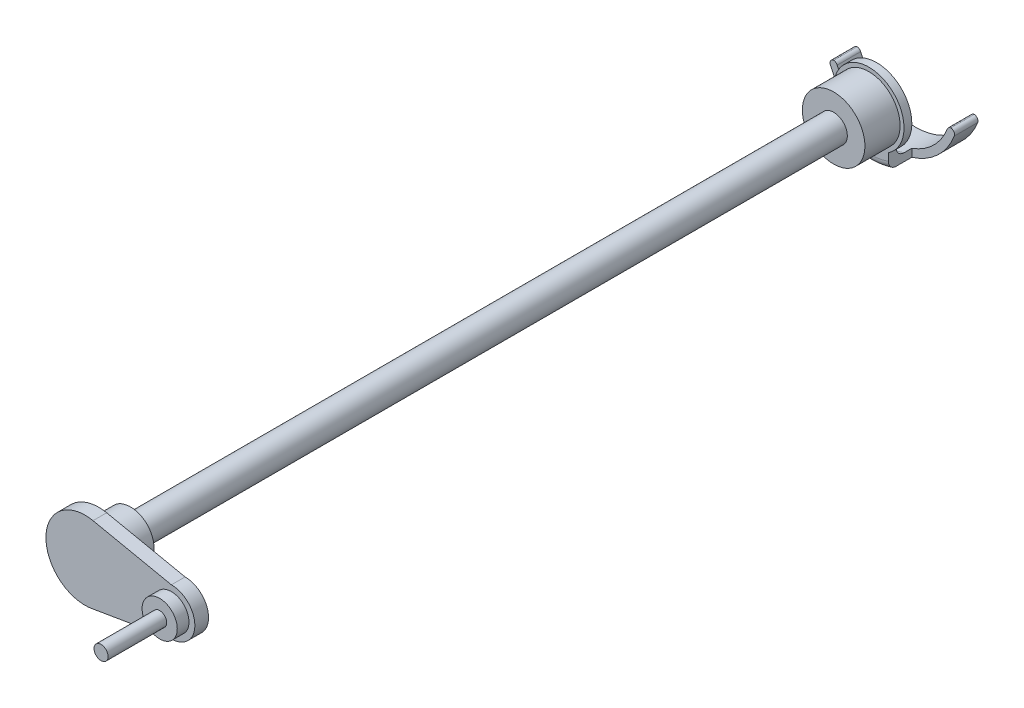
ISO-10303-21;
HEADER;
FILE_DESCRIPTION(('STEP AP214'),'2;1');
FILE_NAME('part.step','',(''),(''),'','','');
FILE_SCHEMA(('AUTOMOTIVE_DESIGN { 1 0 10303 214 1 1 1 1 }'));
ENDSEC;
DATA;
#1=APPLICATION_CONTEXT('core data for automotive mechanical design processes');
#2=APPLICATION_PROTOCOL_DEFINITION('international standard','automotive_design',2000,#1);
#3=PRODUCT_CONTEXT('',#1,'mechanical');
#4=PRODUCT('Part','Part','',(#3));
#5=PRODUCT_RELATED_PRODUCT_CATEGORY('part','',(#4));
#6=PRODUCT_DEFINITION_FORMATION('','',#4);
#7=PRODUCT_DEFINITION_CONTEXT('part definition',#1,'design');
#8=PRODUCT_DEFINITION('design','',#6,#7);
#9=PRODUCT_DEFINITION_SHAPE('','',#8);
#10=(LENGTH_UNIT() NAMED_UNIT(*) SI_UNIT(.MILLI.,.METRE.));
#11=(NAMED_UNIT(*) PLANE_ANGLE_UNIT() SI_UNIT($,.RADIAN.));
#12=(NAMED_UNIT(*) SI_UNIT($,.STERADIAN.) SOLID_ANGLE_UNIT());
#13=UNCERTAINTY_MEASURE_WITH_UNIT(LENGTH_MEASURE(1.E-05),#10,'distance_accuracy_value','');
#14=(GEOMETRIC_REPRESENTATION_CONTEXT(3) GLOBAL_UNCERTAINTY_ASSIGNED_CONTEXT((#13)) GLOBAL_UNIT_ASSIGNED_CONTEXT((#10,
#11,#12)) REPRESENTATION_CONTEXT('',''));
#15=CARTESIAN_POINT('',(0.,0.,0.));
#16=DIRECTION('',(0.,0.,1.));
#17=DIRECTION('',(1.,0.,0.));
#18=AXIS2_PLACEMENT_3D('',#15,#16,#17);
#19=CARTESIAN_POINT('',(0.,0.,180.));
#20=DIRECTION('',(0.,0.,-1.));
#21=DIRECTION('',(-1.,0.,0.));
#22=AXIS2_PLACEMENT_3D('',#19,#20,#21);
#23=CYLINDRICAL_SURFACE('',#22,3.5);
#24=CARTESIAN_POINT('',(0.,0.,0.));
#25=DIRECTION('',(0.,0.,-1.));
#26=DIRECTION('',(-1.,0.,0.));
#27=AXIS2_PLACEMENT_3D('',#24,#25,#26);
#28=CIRCLE('',#27,3.5);
#29=CARTESIAN_POINT('',(-3.5,0.,0.));
#30=VERTEX_POINT('',#29);
#31=EDGE_CURVE('E225',#30,#30,#28,.T.);
#32=CARTESIAN_POINT('',(0.,0.,179.));
#33=DIRECTION('',(0.,0.,1.));
#34=DIRECTION('',(1.,0.,0.));
#35=AXIS2_PLACEMENT_3D('',#32,#33,#34);
#36=CIRCLE('',#35,3.5);
#37=CARTESIAN_POINT('',(-3.5,0.,179.));
#38=VERTEX_POINT('',#37);
#39=EDGE_CURVE('E263',#38,#38,#36,.T.);
#40=CARTESIAN_POINT('',(-3.5,0.,0.));
#41=CARTESIAN_POINT('',(-3.5,0.,1.86458333333336));
#42=CARTESIAN_POINT('',(-3.5,0.,3.7291666666667));
#43=CARTESIAN_POINT('',(-3.5,0.,7.45833333333336));
#44=CARTESIAN_POINT('',(-3.5,0.,9.32291666666669));
#45=CARTESIAN_POINT('',(-3.5,0.,13.0520833333334));
#46=CARTESIAN_POINT('',(-3.5,0.,14.9166666666667));
#47=CARTESIAN_POINT('',(-3.5,0.,18.6458333333334));
#48=CARTESIAN_POINT('',(-3.5,0.,20.5104166666667));
#49=CARTESIAN_POINT('',(-3.5,0.,24.2395833333334));
#50=CARTESIAN_POINT('',(-3.5,0.,26.1041666666667));
#51=CARTESIAN_POINT('',(-3.5,0.,29.8333333333333));
#52=CARTESIAN_POINT('',(-3.5,0.,31.6979166666667));
#53=CARTESIAN_POINT('',(-3.5,0.,35.4270833333334));
#54=CARTESIAN_POINT('',(-3.5,0.,37.2916666666667));
#55=CARTESIAN_POINT('',(-3.5,0.,41.0208333333334));
#56=CARTESIAN_POINT('',(-3.5,0.,42.8854166666667));
#57=CARTESIAN_POINT('',(-3.5,0.,46.6145833333333));
#58=CARTESIAN_POINT('',(-3.5,0.,48.4791666666667));
#59=CARTESIAN_POINT('',(-3.5,0.,52.2083333333333));
#60=CARTESIAN_POINT('',(-3.5,0.,54.0729166666667));
#61=CARTESIAN_POINT('',(-3.5,0.,57.8020833333333));
#62=CARTESIAN_POINT('',(-3.5,0.,59.6666666666667));
#63=CARTESIAN_POINT('',(-3.5,0.,63.3958333333333));
#64=CARTESIAN_POINT('',(-3.5,0.,65.2604166666667));
#65=CARTESIAN_POINT('',(-3.5,0.,68.9895833333333));
#66=CARTESIAN_POINT('',(-3.5,0.,70.8541666666667));
#67=CARTESIAN_POINT('',(-3.5,0.,74.5833333333333));
#68=CARTESIAN_POINT('',(-3.5,0.,76.4479166666667));
#69=CARTESIAN_POINT('',(-3.5,0.,80.1770833333333));
#70=CARTESIAN_POINT('',(-3.5,0.,82.0416666666667));
#71=CARTESIAN_POINT('',(-3.5,0.,85.7708333333333));
#72=CARTESIAN_POINT('',(-3.5,0.,87.6354166666667));
#73=CARTESIAN_POINT('',(-3.5,0.,91.3645833333333));
#74=CARTESIAN_POINT('',(-3.5,0.,93.2291666666667));
#75=CARTESIAN_POINT('',(-3.5,0.,96.9583333333333));
#76=CARTESIAN_POINT('',(-3.5,0.,98.8229166666667));
#77=CARTESIAN_POINT('',(-3.5,0.,102.552083333333));
#78=CARTESIAN_POINT('',(-3.5,0.,104.416666666667));
#79=CARTESIAN_POINT('',(-3.5,0.,108.145833333333));
#80=CARTESIAN_POINT('',(-3.5,0.,110.010416666667));
#81=CARTESIAN_POINT('',(-3.5,0.,113.739583333333));
#82=CARTESIAN_POINT('',(-3.5,0.,115.604166666667));
#83=CARTESIAN_POINT('',(-3.5,0.,119.333333333333));
#84=CARTESIAN_POINT('',(-3.5,0.,121.197916666667));
#85=CARTESIAN_POINT('',(-3.5,0.,124.927083333333));
#86=CARTESIAN_POINT('',(-3.5,0.,126.791666666667));
#87=CARTESIAN_POINT('',(-3.5,0.,130.520833333333));
#88=CARTESIAN_POINT('',(-3.5,0.,132.385416666667));
#89=CARTESIAN_POINT('',(-3.5,0.,136.114583333333));
#90=CARTESIAN_POINT('',(-3.5,0.,137.979166666667));
#91=CARTESIAN_POINT('',(-3.5,0.,141.708333333333));
#92=CARTESIAN_POINT('',(-3.5,0.,143.572916666667));
#93=CARTESIAN_POINT('',(-3.5,0.,147.302083333333));
#94=CARTESIAN_POINT('',(-3.5,0.,149.166666666667));
#95=CARTESIAN_POINT('',(-3.5,0.,152.895833333333));
#96=CARTESIAN_POINT('',(-3.5,0.,154.760416666667));
#97=CARTESIAN_POINT('',(-3.5,0.,158.489583333333));
#98=CARTESIAN_POINT('',(-3.5,0.,160.354166666667));
#99=CARTESIAN_POINT('',(-3.5,0.,164.083333333333));
#100=CARTESIAN_POINT('',(-3.5,0.,165.947916666667));
#101=CARTESIAN_POINT('',(-3.5,0.,169.677083333333));
#102=CARTESIAN_POINT('',(-3.5,0.,171.541666666667));
#103=CARTESIAN_POINT('',(-3.5,0.,175.270833333333));
#104=CARTESIAN_POINT('',(-3.5,0.,177.135416666667));
#105=CARTESIAN_POINT('',(-3.5,0.,179.));
#106=B_SPLINE_CURVE_WITH_KNOTS('',3,(#40,#41,#42,#43,#44,#45,#46,#47,#48,#49,#50,#51,#52,#53,
#54,#55,#56,#57,#58,#59,#60,#61,#62,#63,#64,#65,#66,#67,#68,#69,#70,#71,#72,#73,#74,#75,#76,#77,
#78,#79,#80,#81,#82,#83,#84,#85,#86,#87,#88,#89,#90,#91,#92,#93,#94,#95,#96,#97,#98,#99,#100,
#101,#102,#103,#104,#105),.UNSPECIFIED.,.F.,.F.,(4,2,2,2,2,2,2,2,2,2,2,2,2,2,2,2,2,2,2,2,2,2,2,
2,2,2,2,2,2,2,2,2,4),(0.,5.59375000000001,11.1875,16.78125,22.375,27.96875,33.5625,39.15625,
44.75,50.34375,55.9375,61.53125,67.125,72.71875,78.3125,83.90625,89.5,95.09375,100.6875,
106.28125,111.875,117.46875,123.0625,128.65625,134.25,139.84375,145.4375,151.03125,156.625,
162.21875,167.8125,173.40625,179.),.UNSPECIFIED.);
#107=EDGE_CURVE('BSEAM37',#30,#38,#106,.T.);
#108=ORIENTED_EDGE('',*,*,#31,.F.);
#109=ORIENTED_EDGE('',*,*,#39,.F.);
#110=ORIENTED_EDGE('',*,*,#107,.T.);
#111=ORIENTED_EDGE('',*,*,#107,.F.);
#112=EDGE_LOOP('',(#108,#110,#109,#111));
#113=FACE_BOUND('',#112,.T.);
#114=ADVANCED_FACE('F37',(#113),#23,.T.);
#115=CARTESIAN_POINT('',(0.,0.,179.));
#116=DIRECTION('',(0.,0.,1.));
#117=DIRECTION('',(1.,0.,0.));
#118=AXIS2_PLACEMENT_3D('',#115,#116,#117);
#119=CYLINDRICAL_SURFACE('',#118,6.);
#120=CARTESIAN_POINT('',(0.,0.,179.866025403784));
#121=DIRECTION('',(0.,0.,1.));
#122=DIRECTION('',(1.,0.,0.));
#123=AXIS2_PLACEMENT_3D('',#120,#121,#122);
#124=CIRCLE('',#123,6.);
#125=CARTESIAN_POINT('',(6.,0.,179.866025403784));
#126=VERTEX_POINT('',#125);
#127=EDGE_CURVE('E266',#126,#126,#124,.T.);
#128=ORIENTED_EDGE('',*,*,#127,.T.);
#129=EDGE_LOOP('',(#128));
#130=FACE_BOUND('',#129,.T.);
#131=CARTESIAN_POINT('',(0.,0.,188.));
#132=DIRECTION('',(0.,0.,1.));
#133=DIRECTION('',(1.,0.,0.));
#134=AXIS2_PLACEMENT_3D('',#131,#132,#133);
#135=CIRCLE('',#134,6.);
#136=CARTESIAN_POINT('',(6.,0.,188.));
#137=VERTEX_POINT('',#136);
#138=EDGE_CURVE('E259',#137,#137,#135,.T.);
#139=ORIENTED_EDGE('',*,*,#138,.F.);
#140=EDGE_LOOP('',(#139));
#141=FACE_BOUND('',#140,.T.);
#142=ADVANCED_FACE('F380',(#130,#141),#119,.T.);
#143=CARTESIAN_POINT('',(0.,0.,179.));
#144=DIRECTION('',(0.,0.,1.));
#145=DIRECTION('',(1.,0.,0.));
#146=AXIS2_PLACEMENT_3D('',#143,#144,#145);
#147=PLANE('',#146);
#148=CARTESIAN_POINT('',(0.,0.,179.));
#149=DIRECTION('',(0.,0.,1.));
#150=DIRECTION('',(1.,0.,0.));
#151=AXIS2_PLACEMENT_3D('',#148,#149,#150);
#152=CIRCLE('',#151,4.5);
#153=CARTESIAN_POINT('',(4.5,0.,179.));
#154=VERTEX_POINT('',#153);
#155=EDGE_CURVE('E269',#154,#154,#152,.F.);
#156=ORIENTED_EDGE('',*,*,#155,.T.);
#157=EDGE_LOOP('',(#156));
#158=FACE_BOUND('',#157,.T.);
#159=ORIENTED_EDGE('',*,*,#39,.T.);
#160=EDGE_LOOP('',(#159));
#161=FACE_BOUND('',#160,.T.);
#162=ADVANCED_FACE('F376',(#158,#161),#147,.F.);
#163=CARTESIAN_POINT('',(0.,0.,191.5));
#164=DIRECTION('',(0.,0.,-1.));
#165=DIRECTION('',(-1.,0.,0.));
#166=AXIS2_PLACEMENT_3D('',#163,#164,#165);
#167=CYLINDRICAL_SURFACE('',#166,10.);
#168=CARTESIAN_POINT('',(0.,0.,188.));
#169=DIRECTION('',(0.,0.,1.));
#170=DIRECTION('',(1.,0.,0.));
#171=AXIS2_PLACEMENT_3D('',#168,#169,#170);
#172=CIRCLE('',#171,10.);
#173=CARTESIAN_POINT('',(2.04374816539351,9.78892708300816,188.));
#174=VERTEX_POINT('',#173);
#175=CARTESIAN_POINT('',(2.04374816539351,-9.78892708300816,188.));
#176=VERTEX_POINT('',#175);
#177=EDGE_CURVE('E255',#174,#176,#172,.T.);
#178=ORIENTED_EDGE('',*,*,#177,.T.);
#179=DIRECTION('',(0.,0.,1.));
#180=VECTOR('',#179,1.);
#181=CARTESIAN_POINT('',(2.04374816539351,-9.78892708300816,155.411966848379));
#182=LINE('',#181,#180);
#183=CARTESIAN_POINT('',(2.04374816539351,-9.78892708300816,191.5));
#184=VERTEX_POINT('',#183);
#185=EDGE_CURVE('E248',#176,#184,#182,.T.);
#186=ORIENTED_EDGE('',*,*,#185,.T.);
#187=CARTESIAN_POINT('',(0.,0.,191.5));
#188=DIRECTION('',(0.,0.,1.));
#189=DIRECTION('',(1.,0.,0.));
#190=AXIS2_PLACEMENT_3D('',#187,#188,#189);
#191=CIRCLE('',#190,10.);
#192=CARTESIAN_POINT('',(2.04374816539351,9.78892708300816,191.5));
#193=VERTEX_POINT('',#192);
#194=EDGE_CURVE('E256',#193,#184,#191,.T.);
#195=ORIENTED_EDGE('',*,*,#194,.F.);
#196=DIRECTION('',(0.,0.,1.));
#197=VECTOR('',#196,1.);
#198=CARTESIAN_POINT('',(2.04374816539351,9.78892708300816,155.411966848379));
#199=LINE('',#198,#197);
#200=EDGE_CURVE('E250',#174,#193,#199,.T.);
#201=ORIENTED_EDGE('',*,*,#200,.F.);
#202=EDGE_LOOP('',(#178,#186,#195,#201));
#203=FACE_BOUND('',#202,.T.);
#204=ADVANCED_FACE('F369',(#203),#167,.T.);
#205=CARTESIAN_POINT('',(0.,0.,191.5));
#206=DIRECTION('',(0.,0.,1.));
#207=DIRECTION('',(1.,0.,0.));
#208=AXIS2_PLACEMENT_3D('',#205,#206,#207);
#209=PLANE('',#208);
#210=CARTESIAN_POINT('',(22.0953801861583,-0.397485361182854,191.5));
#211=DIRECTION('',(0.,0.,1.));
#212=DIRECTION('',(1.,0.,0.));
#213=AXIS2_PLACEMENT_3D('',#210,#211,#212);
#214=CIRCLE('',#213,4.5);
#215=CARTESIAN_POINT('',(26.5953801861583,-0.397485361182854,191.5));
#216=VERTEX_POINT('',#215);
#217=EDGE_CURVE('E199',#216,#216,#214,.T.);
#218=ORIENTED_EDGE('',*,*,#217,.F.);
#219=EDGE_LOOP('',(#218));
#220=FACE_BOUND('',#219,.T.);
#221=ORIENTED_EDGE('',*,*,#194,.T.);
#222=DIRECTION('',(0.985996344128621,0.166766931269342,0.));
#223=VECTOR('',#222,1.);
#224=CARTESIAN_POINT('',(2.04374816539351,-9.78892708300816,191.5));
#225=LINE('',#224,#223);
#226=CARTESIAN_POINT('',(22.0953801861583,-6.39748536118285,191.5));
#227=VERTEX_POINT('',#226);
#228=EDGE_CURVE('E243',#184,#227,#225,.T.);
#229=ORIENTED_EDGE('',*,*,#228,.T.);
#230=CARTESIAN_POINT('',(22.0953801861583,-0.397485361182854,191.5));
#231=DIRECTION('',(0.,0.,1.));
#232=DIRECTION('',(1.,0.,0.));
#233=AXIS2_PLACEMENT_3D('',#230,#231,#232);
#234=CIRCLE('',#233,6.);
#235=CARTESIAN_POINT('',(22.0953801861583,5.60251463881715,191.5));
#236=VERTEX_POINT('',#235);
#237=EDGE_CURVE('E230',#227,#236,#234,.T.);
#238=ORIENTED_EDGE('',*,*,#237,.T.);
#239=DIRECTION('',(-0.978892708300816,0.204374816539351,0.));
#240=VECTOR('',#239,1.);
#241=CARTESIAN_POINT('',(2.04374816539351,9.78892708300816,191.5));
#242=LINE('',#241,#240);
#243=EDGE_CURVE('E240',#236,#193,#242,.T.);
#244=ORIENTED_EDGE('',*,*,#243,.T.);
#245=EDGE_LOOP('',(#221,#229,#238,#244));
#246=FACE_BOUND('',#245,.T.);
#247=ADVANCED_FACE('F366',(#220,#246),#209,.T.);
#248=CARTESIAN_POINT('',(0.,0.,188.));
#249=DIRECTION('',(0.,0.,1.));
#250=DIRECTION('',(1.,0.,0.));
#251=AXIS2_PLACEMENT_3D('',#248,#249,#250);
#252=PLANE('',#251);
#253=ORIENTED_EDGE('',*,*,#138,.T.);
#254=EDGE_LOOP('',(#253));
#255=FACE_BOUND('',#254,.T.);
#256=ORIENTED_EDGE('',*,*,#177,.F.);
#257=DIRECTION('',(0.978892708300816,-0.204374816539351,0.));
#258=VECTOR('',#257,1.);
#259=CARTESIAN_POINT('',(2.04374816539351,9.78892708300816,188.));
#260=LINE('',#259,#258);
#261=CARTESIAN_POINT('',(22.0953801861583,5.60251463881715,188.));
#262=VERTEX_POINT('',#261);
#263=EDGE_CURVE('E237',#174,#262,#260,.T.);
#264=ORIENTED_EDGE('',*,*,#263,.T.);
#265=CARTESIAN_POINT('',(22.0953801861583,-0.397485361182854,188.));
#266=DIRECTION('',(0.,0.,1.));
#267=DIRECTION('',(1.,0.,0.));
#268=AXIS2_PLACEMENT_3D('',#265,#266,#267);
#269=CIRCLE('',#268,6.);
#270=CARTESIAN_POINT('',(22.0953801861583,-6.39748536118285,188.));
#271=VERTEX_POINT('',#270);
#272=EDGE_CURVE('E234',#262,#271,#269,.F.);
#273=ORIENTED_EDGE('',*,*,#272,.T.);
#274=DIRECTION('',(-0.985996344128621,-0.166766931269342,0.));
#275=VECTOR('',#274,1.);
#276=CARTESIAN_POINT('',(2.04374816539351,-9.78892708300816,188.));
#277=LINE('',#276,#275);
#278=EDGE_CURVE('E231',#271,#176,#277,.T.);
#279=ORIENTED_EDGE('',*,*,#278,.T.);
#280=EDGE_LOOP('',(#256,#264,#273,#279));
#281=FACE_BOUND('',#280,.T.);
#282=ADVANCED_FACE('F364',(#255,#281),#252,.F.);
#283=CARTESIAN_POINT('',(22.0953801861583,-0.397485361182854,155.411966848379));
#284=DIRECTION('',(0.,0.,1.));
#285=DIRECTION('',(1.,0.,0.));
#286=AXIS2_PLACEMENT_3D('',#283,#284,#285);
#287=CYLINDRICAL_SURFACE('',#286,6.);
#288=ORIENTED_EDGE('',*,*,#272,.F.);
#289=DIRECTION('',(0.,0.,1.));
#290=VECTOR('',#289,1.);
#291=CARTESIAN_POINT('',(22.0953801861583,5.60251463881715,155.411966848379));
#292=LINE('',#291,#290);
#293=EDGE_CURVE('E246',#262,#236,#292,.T.);
#294=ORIENTED_EDGE('',*,*,#293,.T.);
#295=ORIENTED_EDGE('',*,*,#237,.F.);
#296=DIRECTION('',(0.,0.,1.));
#297=VECTOR('',#296,1.);
#298=CARTESIAN_POINT('',(22.0953801861583,-6.39748536118285,155.411966848379));
#299=LINE('',#298,#297);
#300=EDGE_CURVE('E235',#271,#227,#299,.T.);
#301=ORIENTED_EDGE('',*,*,#300,.F.);
#302=EDGE_LOOP('',(#288,#294,#295,#301));
#303=FACE_BOUND('',#302,.T.);
#304=ADVANCED_FACE('F357',(#303),#287,.T.);
#305=CARTESIAN_POINT('',(2.04374816539351,-9.78892708300816,155.411966848379));
#306=DIRECTION('',(0.166766931269342,-0.985996344128621,0.));
#307=DIRECTION('',(0.985996344128621,0.166766931269342,0.));
#308=AXIS2_PLACEMENT_3D('',#305,#306,#307);
#309=PLANE('',#308);
#310=ORIENTED_EDGE('',*,*,#278,.F.);
#311=ORIENTED_EDGE('',*,*,#300,.T.);
#312=ORIENTED_EDGE('',*,*,#228,.F.);
#313=ORIENTED_EDGE('',*,*,#185,.F.);
#314=EDGE_LOOP('',(#310,#311,#312,#313));
#315=FACE_BOUND('',#314,.T.);
#316=ADVANCED_FACE('F353',(#315),#309,.T.);
#317=CARTESIAN_POINT('',(2.04374816539351,9.78892708300816,155.411966848379));
#318=DIRECTION('',(0.204374816539351,0.978892708300816,0.));
#319=DIRECTION('',(-0.978892708300816,0.204374816539351,0.));
#320=AXIS2_PLACEMENT_3D('',#317,#318,#319);
#321=PLANE('',#320);
#322=ORIENTED_EDGE('',*,*,#263,.F.);
#323=ORIENTED_EDGE('',*,*,#200,.T.);
#324=ORIENTED_EDGE('',*,*,#243,.F.);
#325=ORIENTED_EDGE('',*,*,#293,.F.);
#326=EDGE_LOOP('',(#322,#323,#324,#325));
#327=FACE_BOUND('',#326,.T.);
#328=ADVANCED_FACE('F356',(#327),#321,.T.);
#329=CARTESIAN_POINT('',(0.,0.,179.866025403784));
#330=DIRECTION('',(0.,0.,1.));
#331=DIRECTION('',(1.,0.,0.));
#332=AXIS2_PLACEMENT_3D('',#329,#330,#331);
#333=CONICAL_SURFACE('',#332,6.,1.04719755119659);
#334=ORIENTED_EDGE('',*,*,#155,.F.);
#335=EDGE_LOOP('',(#334));
#336=FACE_BOUND('',#335,.T.);
#337=ORIENTED_EDGE('',*,*,#127,.F.);
#338=EDGE_LOOP('',(#337));
#339=FACE_BOUND('',#338,.T.);
#340=ADVANCED_FACE('F301',(#336,#339),#333,.T.);
#341=CARTESIAN_POINT('',(0.,0.,-9.));
#342=DIRECTION('',(0.,0.,1.));
#343=DIRECTION('',(1.,0.,0.));
#344=AXIS2_PLACEMENT_3D('',#341,#342,#343);
#345=CYLINDRICAL_SURFACE('',#344,8.);
#346=CARTESIAN_POINT('',(0.,0.,-9.));
#347=DIRECTION('',(0.,0.,-1.));
#348=DIRECTION('',(-1.,0.,0.));
#349=AXIS2_PLACEMENT_3D('',#346,#347,#348);
#350=CIRCLE('',#349,8.);
#351=CARTESIAN_POINT('',(-8.,0.,-9.));
#352=VERTEX_POINT('',#351);
#353=EDGE_CURVE('E222',#352,#352,#350,.T.);
#354=ORIENTED_EDGE('',*,*,#353,.F.);
#355=EDGE_LOOP('',(#354));
#356=FACE_BOUND('',#355,.T.);
#357=CARTESIAN_POINT('',(0.,0.,0.));
#358=DIRECTION('',(0.,0.,-1.));
#359=DIRECTION('',(-1.,0.,0.));
#360=AXIS2_PLACEMENT_3D('',#357,#358,#359);
#361=CIRCLE('',#360,8.);
#362=CARTESIAN_POINT('',(-8.,0.,0.));
#363=VERTEX_POINT('',#362);
#364=EDGE_CURVE('E220',#363,#363,#361,.T.);
#365=ORIENTED_EDGE('',*,*,#364,.T.);
#366=EDGE_LOOP('',(#365));
#367=FACE_BOUND('',#366,.T.);
#368=ADVANCED_FACE('F348',(#356,#367),#345,.T.);
#369=CARTESIAN_POINT('',(0.,0.,0.));
#370=DIRECTION('',(0.,0.,-1.));
#371=DIRECTION('',(-1.,0.,0.));
#372=AXIS2_PLACEMENT_3D('',#369,#370,#371);
#373=PLANE('',#372);
#374=ORIENTED_EDGE('',*,*,#31,.T.);
#375=EDGE_LOOP('',(#374));
#376=FACE_BOUND('',#375,.T.);
#377=ORIENTED_EDGE('',*,*,#364,.F.);
#378=EDGE_LOOP('',(#377));
#379=FACE_BOUND('',#378,.T.);
#380=ADVANCED_FACE('F342',(#376,#379),#373,.F.);
#381=CARTESIAN_POINT('',(0.,0.,-11.));
#382=DIRECTION('',(0.,0.,1.));
#383=DIRECTION('',(1.,0.,0.));
#384=AXIS2_PLACEMENT_3D('',#381,#382,#383);
#385=CYLINDRICAL_SURFACE('',#384,9.);
#386=CARTESIAN_POINT('',(0.,0.,-11.));
#387=DIRECTION('',(0.,0.,-1.));
#388=DIRECTION('',(-1.,0.,0.));
#389=AXIS2_PLACEMENT_3D('',#386,#387,#388);
#390=CIRCLE('',#389,9.);
#391=CARTESIAN_POINT('',(-5.49760262943732,-7.12575366742381,-11.));
#392=VERTEX_POINT('',#391);
#393=CARTESIAN_POINT('',(5.49760262943732,-7.12575366742381,-11.));
#394=VERTEX_POINT('',#393);
#395=EDGE_CURVE('E217',#392,#394,#390,.T.);
#396=ORIENTED_EDGE('',*,*,#395,.F.);
#397=CARTESIAN_POINT('',(-5.49760262943732,-7.12575366742381,-11.));
#398=CARTESIAN_POINT('',(-5.45715877679109,-7.15695666706355,-11.0000001365799));
#399=CARTESIAN_POINT('',(-5.41644964335511,-7.18781489722535,-11.0000966365752));
#400=CARTESIAN_POINT('',(-5.33452472541951,-7.24882425884151,-11.000468734678));
#401=CARTESIAN_POINT('',(-5.29330909669677,-7.2789755998009,-11.0007442790077));
#402=CARTESIAN_POINT('',(-5.16889213679743,-7.3683775910516,-11.0018192228911));
#403=CARTESIAN_POINT('',(-5.08493001474909,-7.42656904816172,-11.0028669270757));
#404=CARTESIAN_POINT('',(-5.,-7.48331477354788,-11.0041914175792));
#405=B_SPLINE_CURVE_WITH_KNOTS('',3,(#397,#398,#399,#400,#401,#402,#403,#404),.UNSPECIFIED.,.F.,
.F.,(4,2,2,4),(0.,0.153241833560063,0.306437660598625,0.612864467188051),.UNSPECIFIED.);
#406=CARTESIAN_POINT('',(-5.,-7.48331477354788,-11.0041914175792));
#407=VERTEX_POINT('',#406);
#408=EDGE_CURVE('E333',#392,#407,#405,.T.);
#409=ORIENTED_EDGE('',*,*,#408,.T.);
#410=DIRECTION('',(0.,0.,-1.));
#411=VECTOR('',#410,1.);
#412=CARTESIAN_POINT('',(-5.,-7.48331477354788,-9.));
#413=LINE('',#412,#411);
#414=CARTESIAN_POINT('',(-5.,-7.48331477354788,-9.));
#415=VERTEX_POINT('',#414);
#416=EDGE_CURVE('E212',#415,#407,#413,.T.);
#417=ORIENTED_EDGE('',*,*,#416,.F.);
#418=CARTESIAN_POINT('',(0.,0.,-9.));
#419=DIRECTION('',(0.,0.,-1.));
#420=DIRECTION('',(-1.,0.,0.));
#421=AXIS2_PLACEMENT_3D('',#418,#419,#420);
#422=CIRCLE('',#421,9.);
#423=CARTESIAN_POINT('',(5.,-7.48331477354788,-9.));
#424=VERTEX_POINT('',#423);
#425=EDGE_CURVE('E214',#415,#424,#422,.T.);
#426=ORIENTED_EDGE('',*,*,#425,.T.);
#427=DIRECTION('',(0.,0.,-1.));
#428=VECTOR('',#427,1.);
#429=CARTESIAN_POINT('',(5.,-7.48331477354788,-9.));
#430=LINE('',#429,#428);
#431=CARTESIAN_POINT('',(5.,-7.48331477354788,-11.0041914175792));
#432=VERTEX_POINT('',#431);
#433=EDGE_CURVE('E183',#424,#432,#430,.T.);
#434=ORIENTED_EDGE('',*,*,#433,.T.);
#435=CARTESIAN_POINT('',(5.,-7.48331477354788,-11.0041914175792));
#436=CARTESIAN_POINT('',(5.08493001474909,-7.42656904816173,-11.0028669270757));
#437=CARTESIAN_POINT('',(5.16889213679743,-7.3683775910516,-11.0018192228911));
#438=CARTESIAN_POINT('',(5.29330909669677,-7.2789755998009,-11.0007442790077));
#439=CARTESIAN_POINT('',(5.33452472541951,-7.24882425884151,-11.000468734678));
#440=CARTESIAN_POINT('',(5.41644964335511,-7.18781489722535,-11.0000966365752));
#441=CARTESIAN_POINT('',(5.45715877679109,-7.15695666706355,-11.0000001365799));
#442=CARTESIAN_POINT('',(5.49760262943732,-7.12575366742381,-11.));
#443=B_SPLINE_CURVE_WITH_KNOTS('',3,(#435,#436,#437,#438,#439,#440,#441,#442),.UNSPECIFIED.,.F.,
.F.,(4,2,2,4),(0.,0.306426806589428,0.45962263362799,0.612864467188055),.UNSPECIFIED.);
#444=EDGE_CURVE('E326',#432,#394,#443,.T.);
#445=ORIENTED_EDGE('',*,*,#444,.T.);
#446=EDGE_LOOP('',(#396,#409,#417,#426,#434,#445));
#447=FACE_BOUND('',#446,.T.);
#448=ADVANCED_FACE('F338',(#447),#385,.T.);
#449=CARTESIAN_POINT('',(0.,0.,-11.));
#450=DIRECTION('',(0.,0.,-1.));
#451=DIRECTION('',(-1.,0.,0.));
#452=AXIS2_PLACEMENT_3D('',#449,#450,#451);
#453=PLANE('',#452);
#454=ORIENTED_EDGE('',*,*,#395,.T.);
#455=CARTESIAN_POINT('',(0.,4.76476203572404,-11.));
#456=DIRECTION('',(0.,0.,-1.));
#457=DIRECTION('',(-1.,0.,0.));
#458=AXIS2_PLACEMENT_3D('',#455,#456,#457);
#459=CIRCLE('',#458,13.0999236012277);
#460=EDGE_CURVE('E327',#394,#392,#459,.T.);
#461=ORIENTED_EDGE('',*,*,#460,.T.);
#462=EDGE_LOOP('',(#454,#461));
#463=FACE_BOUND('',#462,.T.);
#464=ADVANCED_FACE('F316',(#463),#453,.T.);
#465=CARTESIAN_POINT('',(0.,0.,-9.));
#466=DIRECTION('',(0.,0.,-1.));
#467=DIRECTION('',(-1.,0.,0.));
#468=AXIS2_PLACEMENT_3D('',#465,#466,#467);
#469=PLANE('',#468);
#470=ORIENTED_EDGE('',*,*,#353,.T.);
#471=EDGE_LOOP('',(#470));
#472=FACE_BOUND('',#471,.T.);
#473=DIRECTION('',(0.,1.,0.));
#474=VECTOR('',#473,1.);
#475=CARTESIAN_POINT('',(-5.,-11.4833147735479,-9.));
#476=LINE('',#475,#474);
#477=CARTESIAN_POINT('',(-5.,-9.37737358800691,-9.));
#478=VERTEX_POINT('',#477);
#479=EDGE_CURVE('E210',#478,#415,#476,.T.);
#480=ORIENTED_EDGE('',*,*,#479,.F.);
#481=CARTESIAN_POINT('',(0.,4.76476203572404,-9.));
#482=DIRECTION('',(0.,0.,-1.));
#483=DIRECTION('',(-1.,0.,0.));
#484=AXIS2_PLACEMENT_3D('',#481,#482,#483);
#485=CIRCLE('',#484,15.);
#486=CARTESIAN_POINT('',(5.,-9.37737358800691,-9.));
#487=VERTEX_POINT('',#486);
#488=EDGE_CURVE('E287',#478,#487,#485,.F.);
#489=ORIENTED_EDGE('',*,*,#488,.T.);
#490=DIRECTION('',(0.,-1.,0.));
#491=VECTOR('',#490,1.);
#492=CARTESIAN_POINT('',(5.,-7.48331477354788,-9.));
#493=LINE('',#492,#491);
#494=EDGE_CURVE('E206',#424,#487,#493,.T.);
#495=ORIENTED_EDGE('',*,*,#494,.F.);
#496=ORIENTED_EDGE('',*,*,#425,.F.);
#497=EDGE_LOOP('',(#480,#489,#495,#496));
#498=FACE_BOUND('',#497,.T.);
#499=ADVANCED_FACE('F344',(#472,#498),#469,.F.);
#500=CARTESIAN_POINT('',(-5.,-11.4833147735479,-9.));
#501=DIRECTION('',(-1.,0.,0.));
#502=DIRECTION('',(0.,0.,1.));
#503=AXIS2_PLACEMENT_3D('',#500,#501,#502);
#504=PLANE('',#503);
#505=DIRECTION('',(0.,0.,-1.));
#506=VECTOR('',#505,1.);
#507=CARTESIAN_POINT('',(-5.,-11.4833147735479,-9.));
#508=LINE('',#507,#506);
#509=CARTESIAN_POINT('',(-5.,-11.4833147735479,-11.));
#510=VERTEX_POINT('',#509);
#511=CARTESIAN_POINT('',(-5.,-11.4833147735479,-15.));
#512=VERTEX_POINT('',#511);
#513=EDGE_CURVE('E182',#510,#512,#508,.T.);
#514=ORIENTED_EDGE('',*,*,#513,.F.);
#515=CARTESIAN_POINT('',(-5.,-11.4833147735479,-11.));
#516=CARTESIAN_POINT('',(-5.,-11.4833155478497,-10.9455960088725));
#517=CARTESIAN_POINT('',(-5.,-11.4809906412141,-10.8912186696762));
#518=CARTESIAN_POINT('',(-5.,-11.4717234415717,-10.7828658112036));
#519=CARTESIAN_POINT('',(-5.,-11.4647817375781,-10.7288902415577));
#520=CARTESIAN_POINT('',(-5.,-11.4371326241968,-10.568364866949));
#521=CARTESIAN_POINT('',(-5.,-11.4096007744453,-10.4629113412134));
#522=CARTESIAN_POINT('',(-5.,-11.3372799239994,-10.2581622742975));
#523=CARTESIAN_POINT('',(-5.,-11.2924893179737,-10.1588673069561));
#524=CARTESIAN_POINT('',(-5.,-11.1871444420387,-9.96901268809671));
#525=CARTESIAN_POINT('',(-5.,-11.1265879366404,-9.87845427785622));
#526=CARTESIAN_POINT('',(-5.,-10.9904652426783,-9.70687094271393));
#527=CARTESIAN_POINT('',(-5.,-10.9146577146168,-9.6260378502206));
#528=CARTESIAN_POINT('',(-5.,-10.751034058922,-9.47761775938467));
#529=CARTESIAN_POINT('',(-5.,-10.6632155191815,-9.41003342837049));
#530=CARTESIAN_POINT('',(-5.,-10.4741561386994,-9.28695917152131));
#531=CARTESIAN_POINT('',(-5.,-10.3725052996874,-9.2320998915247));
#532=CARTESIAN_POINT('',(-5.,-10.1617310091452,-9.13931948925152));
#533=CARTESIAN_POINT('',(-5.,-10.0526059266774,-9.10140207748826));
#534=CARTESIAN_POINT('',(-5.,-9.84922714952093,-9.04818695164438));
#535=CARTESIAN_POINT('',(-5.,-9.75568880268316,-9.03010176565335));
#536=CARTESIAN_POINT('',(-5.,-9.56722586761579,-9.00600818133659));
#537=CARTESIAN_POINT('',(-5.,-9.47230385251526,-8.99997968476176));
#538=CARTESIAN_POINT('',(-5.,-9.37737358800691,-9.));
#539=B_SPLINE_CURVE_WITH_KNOTS('',3,(#515,#516,#517,#518,#519,#520,#521,#522,#523,#524,#525,
#526,#527,#528,#529,#530,#531,#532,#533,#534,#535,#536,#537,#538),.UNSPECIFIED.,.F.,.F.,(4,2,2,
2,2,2,2,2,2,2,2,4),(0.,0.163109692410669,0.326198579201109,0.651473067658435,0.976777818981564,
1.30212872128064,1.63310305360503,1.96414395159519,2.30915300961894,2.65423759260478,
2.93929092805575,3.22386868816695),.UNSPECIFIED.);
#540=EDGE_CURVE('E280',#510,#478,#539,.T.);
#541=ORIENTED_EDGE('',*,*,#540,.T.);
#542=ORIENTED_EDGE('',*,*,#479,.T.);
#543=ORIENTED_EDGE('',*,*,#416,.T.);
#544=CARTESIAN_POINT('',(-5.,-7.48331477354788,-11.0041914175792));
#545=CARTESIAN_POINT('',(-5.,-7.54630943895849,-11.0079758098445));
#546=CARTESIAN_POINT('',(-5.,-7.60912439826671,-11.0143172559091));
#547=CARTESIAN_POINT('',(-5.,-7.73403624626522,-11.0321314409002));
#548=CARTESIAN_POINT('',(-5.,-7.79613296645962,-11.0436053598035));
#549=CARTESIAN_POINT('',(-5.,-7.98091351763802,-11.0857813598383));
#550=CARTESIAN_POINT('',(-5.,-8.10193289380741,-11.124228582731));
#551=CARTESIAN_POINT('',(-5.,-8.33581289030113,-11.2213388372435));
#552=CARTESIAN_POINT('',(-5.,-8.44865769540094,-11.2800398529378));
#553=CARTESIAN_POINT('',(-5.,-8.66208025291418,-11.4164808664408));
#554=CARTESIAN_POINT('',(-5.,-8.76267271210898,-11.494197694976));
#555=CARTESIAN_POINT('',(-5.,-8.94322712950838,-11.6624174947116));
#556=CARTESIAN_POINT('',(-5.,-9.02397396710306,-11.7520774054814));
#557=CARTESIAN_POINT('',(-5.,-9.16807205116987,-11.9445346613716));
#558=CARTESIAN_POINT('',(-5.,-9.23141934150062,-12.0473349864595));
#559=CARTESIAN_POINT('',(-5.,-9.33465683476664,-12.255986136889));
#560=CARTESIAN_POINT('',(-5.,-9.37578110049792,-12.3612287703527));
#561=CARTESIAN_POINT('',(-5.,-9.43879275384918,-12.5772110190562));
#562=CARTESIAN_POINT('',(-5.,-9.46071870394774,-12.6879391407698));
#563=CARTESIAN_POINT('',(-5.,-9.47620223496084,-12.8328782149476));
#564=CARTESIAN_POINT('',(-5.,-9.47887034030217,-12.8662738626643));
#565=CARTESIAN_POINT('',(-5.,-9.48242406410896,-12.9331081188457));
#566=CARTESIAN_POINT('',(-5.,-9.48331243309876,-12.9665465809767));
#567=CARTESIAN_POINT('',(-5.,-9.48331477354789,-13.));
#568=B_SPLINE_CURVE_WITH_KNOTS('',3,(#544,#545,#546,#547,#548,#549,#550,#551,#552,#553,#554,
#555,#556,#557,#558,#559,#560,#561,#562,#563,#564,#565,#566,#567),.UNSPECIFIED.,.F.,.F.,(4,2,2,
2,2,2,2,2,2,2,2,4),(0.,0.189217932529681,0.37847938942081,0.757461957866985,1.13715917066899,
1.51639603607449,1.87649682652039,2.23667942556386,2.57399113399382,2.91062374047247,
3.01109772300388,3.11141630612163),.UNSPECIFIED.);
#569=CARTESIAN_POINT('',(-5.,-9.48331477354788,-13.));
#570=VERTEX_POINT('',#569);
#571=EDGE_CURVE('E707',#407,#570,#568,.T.);
#572=ORIENTED_EDGE('',*,*,#571,.T.);
#573=DIRECTION('',(0.,0.,1.));
#574=VECTOR('',#573,1.);
#575=CARTESIAN_POINT('',(-5.,-9.48331477354788,-15.));
#576=LINE('',#575,#574);
#577=CARTESIAN_POINT('',(-4.99999999999999,-9.48331477354789,-15.));
#578=VERTEX_POINT('',#577);
#579=EDGE_CURVE('E189',#578,#570,#576,.T.);
#580=ORIENTED_EDGE('',*,*,#579,.F.);
#581=DIRECTION('',(0.,1.,0.));
#582=VECTOR('',#581,1.);
#583=CARTESIAN_POINT('',(-5.,-9.48331477354788,-15.));
#584=LINE('',#583,#582);
#585=EDGE_CURVE('E187',#512,#578,#584,.T.);
#586=ORIENTED_EDGE('',*,*,#585,.F.);
#587=EDGE_LOOP('',(#514,#541,#542,#543,#572,#580,#586));
#588=FACE_BOUND('',#587,.T.);
#589=ADVANCED_FACE('F289',(#588),#504,.T.);
#590=CARTESIAN_POINT('',(5.,-7.48331477354788,-9.));
#591=DIRECTION('',(1.,0.,0.));
#592=DIRECTION('',(0.,1.,0.));
#593=AXIS2_PLACEMENT_3D('',#590,#591,#592);
#594=PLANE('',#593);
#595=ORIENTED_EDGE('',*,*,#494,.T.);
#596=CARTESIAN_POINT('',(5.,-9.37737358800691,-9.));
#597=CARTESIAN_POINT('',(5.,-9.43920145812954,-9.00000219260884));
#598=CARTESIAN_POINT('',(5.,-9.50100203524348,-9.00255001903739));
#599=CARTESIAN_POINT('',(5.,-9.62418834226032,-9.01274875258286));
#600=CARTESIAN_POINT('',(5.,-9.68557401611381,-9.02040033577973));
#601=CARTESIAN_POINT('',(5.,-9.86858245733158,-9.05103395399055));
#602=CARTESIAN_POINT('',(5.,-9.98901668243975,-9.0816948719295));
#603=CARTESIAN_POINT('',(5.,-10.2230595764243,-9.1630657503059));
#604=CARTESIAN_POINT('',(5.,-10.3366585790356,-9.21380336923651));
#605=CARTESIAN_POINT('',(5.,-10.553236243804,-9.33427349783409));
#606=CARTESIAN_POINT('',(5.,-10.6562236388811,-9.4039902135635));
#607=CARTESIAN_POINT('',(5.,-10.844756931473,-9.55800580031829));
#608=CARTESIAN_POINT('',(5.,-10.9307833893243,-9.6417159572227));
#609=CARTESIAN_POINT('',(5.,-11.0866847434833,-9.8230966511689));
#610=CARTESIAN_POINT('',(5.,-11.1565581979226,-9.92076843321133));
#611=CARTESIAN_POINT('',(5.,-11.2744566841621,-10.1219952239863));
#612=CARTESIAN_POINT('',(5.,-11.3233954805156,-10.2250160636807));
#613=CARTESIAN_POINT('',(5.,-11.4024462850526,-10.4379808298411));
#614=CARTESIAN_POINT('',(5.,-11.432582658023,-10.547915592699));
#615=CARTESIAN_POINT('',(5.,-11.4629322330263,-10.7157305142046));
#616=CARTESIAN_POINT('',(5.,-11.4705733043638,-10.7723576979405));
#617=CARTESIAN_POINT('',(5.,-11.4807610949255,-10.8859801985117));
#618=CARTESIAN_POINT('',(5.,-11.4833156663086,-10.9429748114512));
#619=CARTESIAN_POINT('',(5.,-11.4833147735479,-11.));
#620=B_SPLINE_CURVE_WITH_KNOTS('',3,(#596,#597,#598,#599,#600,#601,#602,#603,#604,#605,#606,
#607,#608,#609,#610,#611,#612,#613,#614,#615,#616,#617,#618,#619),.UNSPECIFIED.,.F.,.F.,(4,2,2,
2,2,2,2,2,2,2,2,4),(0.,0.185375397232443,0.370775355487932,0.741693675829686,1.11312477763809,
1.48424772352512,1.84251624937808,2.20081674307972,2.54129787962083,2.88133688832799,
3.05255950904379,3.22351760349847),.UNSPECIFIED.);
#621=CARTESIAN_POINT('',(5.,-11.4833147735479,-11.));
#622=VERTEX_POINT('',#621);
#623=EDGE_CURVE('E181',#487,#622,#620,.T.);
#624=ORIENTED_EDGE('',*,*,#623,.T.);
#625=DIRECTION('',(0.,0.,-1.));
#626=VECTOR('',#625,1.);
#627=CARTESIAN_POINT('',(5.,-11.4833147735479,-9.));
#628=LINE('',#627,#626);
#629=CARTESIAN_POINT('',(5.,-11.4833147735479,-15.));
#630=VERTEX_POINT('',#629);
#631=EDGE_CURVE('E165',#622,#630,#628,.T.);
#632=ORIENTED_EDGE('',*,*,#631,.T.);
#633=DIRECTION('',(0.,-1.,0.));
#634=VECTOR('',#633,1.);
#635=CARTESIAN_POINT('',(5.,-11.4833147735479,-15.));
#636=LINE('',#635,#634);
#637=CARTESIAN_POINT('',(5.,-9.48331477354788,-15.));
#638=VERTEX_POINT('',#637);
#639=EDGE_CURVE('E179',#638,#630,#636,.T.);
#640=ORIENTED_EDGE('',*,*,#639,.F.);
#641=DIRECTION('',(0.,0.,1.));
#642=VECTOR('',#641,1.);
#643=CARTESIAN_POINT('',(5.,-9.48331477354788,-15.));
#644=LINE('',#643,#642);
#645=CARTESIAN_POINT('',(5.,-9.48331477354788,-13.));
#646=VERTEX_POINT('',#645);
#647=EDGE_CURVE('E186',#638,#646,#644,.T.);
#648=ORIENTED_EDGE('',*,*,#647,.T.);
#649=CARTESIAN_POINT('',(5.,-9.48331477354788,-13.));
#650=CARTESIAN_POINT('',(5.,-9.4833158305548,-12.9461180478383));
#651=CARTESIAN_POINT('',(5.,-9.48100556913675,-12.8922626593943));
#652=CARTESIAN_POINT('',(5.,-9.471798729618,-12.784953295226));
#653=CARTESIAN_POINT('',(5.,-9.46490283113178,-12.7314992612059));
#654=CARTESIAN_POINT('',(5.,-9.43744566998757,-12.5725590728198));
#655=CARTESIAN_POINT('',(5.,-9.41011442877476,-12.4681643370783));
#656=CARTESIAN_POINT('',(5.,-9.33837838964703,-12.2654945359284));
#657=CARTESIAN_POINT('',(5.,-9.29397362139683,-12.1672194598876));
#658=CARTESIAN_POINT('',(5.,-9.1896270807821,-11.9792835940941));
#659=CARTESIAN_POINT('',(5.,-9.12968233261611,-11.8896244587483));
#660=CARTESIAN_POINT('',(5.,-8.99477742297893,-11.7192837619341));
#661=CARTESIAN_POINT('',(5.,-8.91952290735617,-11.6388358716507));
#662=CARTESIAN_POINT('',(5.,-8.75718092720149,-11.4909285677163));
#663=CARTESIAN_POINT('',(5.,-8.67008994112873,-11.4234730339927));
#664=CARTESIAN_POINT('',(5.,-8.48162426092196,-11.2995664829483));
#665=CARTESIAN_POINT('',(5.,-8.37973332251117,-11.2439022360285));
#666=CARTESIAN_POINT('',(5.,-8.16846071474214,-11.1493131875428));
#667=CARTESIAN_POINT('',(5.,-8.05907889668097,-11.1103887183932));
#668=CARTESIAN_POINT('',(5.,-7.87155527828437,-11.0594615697242));
#669=CARTESIAN_POINT('',(5.,-7.79463195212581,-11.0428290333263));
#670=CARTESIAN_POINT('',(5.,-7.63966003427248,-11.0175511781705));
#671=CARTESIAN_POINT('',(5.,-7.56161436880962,-11.0088879457076));
#672=CARTESIAN_POINT('',(5.,-7.48331477354788,-11.0041914175792));
#673=B_SPLINE_CURVE_WITH_KNOTS('',3,(#649,#650,#651,#652,#653,#654,#655,#656,#657,#658,#659,
#660,#661,#662,#663,#664,#665,#666,#667,#668,#669,#670,#671,#672),.UNSPECIFIED.,.F.,.F.,(4,2,2,
2,2,2,2,2,2,2,2,4),(0.,0.161543979378826,0.32306402246138,0.645125565735321,0.967186549440019,
1.28930925126781,1.61833771272369,1.94746428062363,2.29428851123448,2.64111962871853,
2.87683446205396,3.11201814256579),.UNSPECIFIED.);
#674=EDGE_CURVE('E320',#646,#432,#673,.T.);
#675=ORIENTED_EDGE('',*,*,#674,.T.);
#676=ORIENTED_EDGE('',*,*,#433,.F.);
#677=EDGE_LOOP('',(#595,#624,#632,#640,#648,#675,#676));
#678=FACE_BOUND('',#677,.T.);
#679=ADVANCED_FACE('F177',(#678),#594,.T.);
#680=CARTESIAN_POINT('',(22.0953801861583,-0.397485361182854,194.5));
#681=DIRECTION('',(0.,0.,-1.));
#682=DIRECTION('',(-1.,0.,0.));
#683=AXIS2_PLACEMENT_3D('',#680,#681,#682);
#684=CYLINDRICAL_SURFACE('',#683,4.5);
#685=CARTESIAN_POINT('',(22.0953801861583,-0.397485361182854,194.5));
#686=DIRECTION('',(0.,0.,1.));
#687=DIRECTION('',(1.,0.,0.));
#688=AXIS2_PLACEMENT_3D('',#685,#686,#687);
#689=CIRCLE('',#688,4.5);
#690=CARTESIAN_POINT('',(26.5953801861583,-0.397485361182854,194.5));
#691=VERTEX_POINT('',#690);
#692=EDGE_CURVE('E203',#691,#691,#689,.T.);
#693=ORIENTED_EDGE('',*,*,#692,.F.);
#694=EDGE_LOOP('',(#693));
#695=FACE_BOUND('',#694,.T.);
#696=ORIENTED_EDGE('',*,*,#217,.T.);
#697=EDGE_LOOP('',(#696));
#698=FACE_BOUND('',#697,.T.);
#699=ADVANCED_FACE('F315',(#695,#698),#684,.T.);
#700=CARTESIAN_POINT('',(0.,0.,194.5));
#701=DIRECTION('',(0.,0.,1.));
#702=DIRECTION('',(1.,0.,0.));
#703=AXIS2_PLACEMENT_3D('',#700,#701,#702);
#704=PLANE('',#703);
#705=CARTESIAN_POINT('',(22.0953801861583,-0.397485361182854,194.5));
#706=DIRECTION('',(0.,0.,1.));
#707=DIRECTION('',(1.,0.,0.));
#708=AXIS2_PLACEMENT_3D('',#705,#706,#707);
#709=CIRCLE('',#708,1.8);
#710=CARTESIAN_POINT('',(23.8953801861583,-0.397485361182854,194.5));
#711=VERTEX_POINT('',#710);
#712=EDGE_CURVE('E200',#711,#711,#709,.T.);
#713=ORIENTED_EDGE('',*,*,#712,.F.);
#714=EDGE_LOOP('',(#713));
#715=FACE_BOUND('',#714,.T.);
#716=ORIENTED_EDGE('',*,*,#692,.T.);
#717=EDGE_LOOP('',(#716));
#718=FACE_BOUND('',#717,.T.);
#719=ADVANCED_FACE('F475',(#715,#718),#704,.T.);
#720=CARTESIAN_POINT('',(22.0953801861583,-0.397485361182854,209.5));
#721=DIRECTION('',(0.,0.,-1.));
#722=DIRECTION('',(-1.,0.,0.));
#723=AXIS2_PLACEMENT_3D('',#720,#721,#722);
#724=CYLINDRICAL_SURFACE('',#723,1.8);
#725=CARTESIAN_POINT('',(22.0953801861583,-0.397485361182854,209.5));
#726=DIRECTION('',(0.,0.,1.));
#727=DIRECTION('',(1.,0.,0.));
#728=AXIS2_PLACEMENT_3D('',#725,#726,#727);
#729=CIRCLE('',#728,1.8);
#730=CARTESIAN_POINT('',(23.8953801861583,-0.397485361182854,209.5));
#731=VERTEX_POINT('',#730);
#732=EDGE_CURVE('E196',#731,#731,#729,.T.);
#733=ORIENTED_EDGE('',*,*,#732,.F.);
#734=EDGE_LOOP('',(#733));
#735=FACE_BOUND('',#734,.T.);
#736=ORIENTED_EDGE('',*,*,#712,.T.);
#737=EDGE_LOOP('',(#736));
#738=FACE_BOUND('',#737,.T.);
#739=ADVANCED_FACE('F482',(#735,#738),#724,.T.);
#740=CARTESIAN_POINT('',(22.0953801861583,-0.397485361182854,209.5));
#741=DIRECTION('',(0.,0.,1.));
#742=DIRECTION('',(1.,0.,0.));
#743=AXIS2_PLACEMENT_3D('',#740,#741,#742);
#744=PLANE('',#743);
#745=ORIENTED_EDGE('',*,*,#732,.T.);
#746=EDGE_LOOP('',(#745));
#747=FACE_BOUND('',#746,.T.);
#748=ADVANCED_FACE('F490',(#747),#744,.T.);
#749=CARTESIAN_POINT('',(0.,4.76476203572404,-15.));
#750=DIRECTION('',(0.,0.,-1.));
#751=DIRECTION('',(-1.,0.,0.));
#752=AXIS2_PLACEMENT_3D('',#749,#750,#751);
#753=PLANE('',#752);
#754=CARTESIAN_POINT('',(-15.0324668180855,-1.,-15.));
#755=DIRECTION('',(0.,0.,-1.));
#756=DIRECTION('',(-1.,0.,0.));
#757=AXIS2_PLACEMENT_3D('',#754,#755,#756);
#758=CIRCLE('',#757,1.);
#759=CARTESIAN_POINT('',(-14.0987687962552,-0.641938547131712,-15.));
#760=VERTEX_POINT('',#759);
#761=CARTESIAN_POINT('',(-14.9789326303613,-0.00143398278095483,-15.));
#762=VERTEX_POINT('',#761);
#763=EDGE_CURVE('E705',#760,#762,#758,.F.);
#764=ORIENTED_EDGE('',*,*,#763,.T.);
#765=CARTESIAN_POINT('',(-14.9253984426371,-1.,-15.));
#766=DIRECTION('',(0.,0.,-1.));
#767=DIRECTION('',(-1.,0.,0.));
#768=AXIS2_PLACEMENT_3D('',#765,#766,#767);
#769=CIRCLE('',#768,1.);
#770=CARTESIAN_POINT('',(-15.8582358453019,-1.36029762723275,-15.));
#771=VERTEX_POINT('',#770);
#772=EDGE_CURVE('E706',#762,#771,#769,.F.);
#773=ORIENTED_EDGE('',*,*,#772,.T.);
#774=CARTESIAN_POINT('',(0.,4.76476203572404,-15.));
#775=DIRECTION('',(0.,0.,-1.));
#776=DIRECTION('',(-1.,0.,0.));
#777=AXIS2_PLACEMENT_3D('',#774,#775,#776);
#778=CIRCLE('',#777,17.);
#779=EDGE_CURVE('E172',#512,#771,#778,.T.);
#780=ORIENTED_EDGE('',*,*,#779,.F.);
#781=ORIENTED_EDGE('',*,*,#585,.T.);
#782=CARTESIAN_POINT('',(0.,4.76476203572404,-15.));
#783=DIRECTION('',(0.,0.,1.));
#784=DIRECTION('',(-1.,0.,0.));
#785=AXIS2_PLACEMENT_3D('',#782,#783,#784);
#786=CIRCLE('',#785,15.0999236012277);
#787=EDGE_CURVE('E693',#760,#578,#786,.T.);
#788=ORIENTED_EDGE('',*,*,#787,.F.);
#789=EDGE_LOOP('',(#764,#773,#780,#781,#788));
#790=FACE_BOUND('',#789,.T.);
#791=ADVANCED_FACE('F497',(#790),#753,.F.);
#792=CARTESIAN_POINT('',(15.8582358453019,-1.36029762723275,-15.));
#793=VERTEX_POINT('',#792);
#794=EDGE_CURVE('E160',#793,#630,#778,.T.);
#795=ORIENTED_EDGE('',*,*,#794,.F.);
#796=CARTESIAN_POINT('',(14.9253984426371,-1.,-15.));
#797=DIRECTION('',(0.,0.,-1.));
#798=DIRECTION('',(-1.,0.,0.));
#799=AXIS2_PLACEMENT_3D('',#796,#797,#798);
#800=CIRCLE('',#799,1.);
#801=CARTESIAN_POINT('',(14.9789326303613,-0.00143398278095483,-15.));
#802=VERTEX_POINT('',#801);
#803=EDGE_CURVE('E11',#793,#802,#800,.F.);
#804=ORIENTED_EDGE('',*,*,#803,.T.);
#805=CARTESIAN_POINT('',(15.0324668180855,-1.,-15.));
#806=DIRECTION('',(0.,0.,-1.));
#807=DIRECTION('',(-1.,0.,0.));
#808=AXIS2_PLACEMENT_3D('',#805,#806,#807);
#809=CIRCLE('',#808,1.);
#810=CARTESIAN_POINT('',(14.0987687962552,-0.641938547131712,-15.));
#811=VERTEX_POINT('',#810);
#812=EDGE_CURVE('E46',#802,#811,#809,.F.);
#813=ORIENTED_EDGE('',*,*,#812,.T.);
#814=EDGE_CURVE('E171',#638,#811,#786,.T.);
#815=ORIENTED_EDGE('',*,*,#814,.F.);
#816=ORIENTED_EDGE('',*,*,#639,.T.);
#817=EDGE_LOOP('',(#795,#804,#813,#815,#816));
#818=FACE_BOUND('',#817,.T.);
#819=ADVANCED_FACE('F185',(#818),#753,.F.);
#820=CARTESIAN_POINT('',(0.,4.76476203572404,-21.));
#821=DIRECTION('',(0.,0.,1.));
#822=DIRECTION('',(1.,0.,0.));
#823=AXIS2_PLACEMENT_3D('',#820,#821,#822);
#824=CYLINDRICAL_SURFACE('',#823,17.);
#825=ORIENTED_EDGE('',*,*,#779,.T.);
#826=DIRECTION('',(0.,0.,1.));
#827=VECTOR('',#826,1.);
#828=CARTESIAN_POINT('',(-15.858235845302,-1.36029762723276,-21.));
#829=LINE('',#828,#827);
#830=CARTESIAN_POINT('',(-15.8582358453019,-1.36029762723275,-21.));
#831=VERTEX_POINT('',#830);
#832=EDGE_CURVE('E675',#771,#831,#829,.F.);
#833=ORIENTED_EDGE('',*,*,#832,.T.);
#834=CARTESIAN_POINT('',(0.,4.76476203572404,-21.));
#835=DIRECTION('',(0.,0.,-1.));
#836=DIRECTION('',(-1.,0.,0.));
#837=AXIS2_PLACEMENT_3D('',#834,#835,#836);
#838=CIRCLE('',#837,17.);
#839=CARTESIAN_POINT('',(15.8582358453019,-1.36029762723275,-21.));
#840=VERTEX_POINT('',#839);
#841=EDGE_CURVE('E694',#840,#831,#838,.T.);
#842=ORIENTED_EDGE('',*,*,#841,.F.);
#843=DIRECTION('',(0.,0.,1.));
#844=VECTOR('',#843,1.);
#845=CARTESIAN_POINT('',(15.858235845302,-1.36029762723276,-21.));
#846=LINE('',#845,#844);
#847=EDGE_CURVE('E169',#840,#793,#846,.T.);
#848=ORIENTED_EDGE('',*,*,#847,.T.);
#849=ORIENTED_EDGE('',*,*,#794,.T.);
#850=ORIENTED_EDGE('',*,*,#631,.F.);
#851=CARTESIAN_POINT('',(0.,4.76476203572404,-11.));
#852=DIRECTION('',(0.,0.,-1.));
#853=DIRECTION('',(-1.,0.,0.));
#854=AXIS2_PLACEMENT_3D('',#851,#852,#853);
#855=CIRCLE('',#854,17.);
#856=EDGE_CURVE('E271',#622,#510,#855,.T.);
#857=ORIENTED_EDGE('',*,*,#856,.T.);
#858=ORIENTED_EDGE('',*,*,#513,.T.);
#859=EDGE_LOOP('',(#825,#833,#842,#848,#849,#850,#857,#858));
#860=FACE_BOUND('',#859,.T.);
#861=ADVANCED_FACE('F163',(#860),#824,.T.);
#862=CARTESIAN_POINT('',(0.,4.76476203572404,-21.));
#863=DIRECTION('',(0.,0.,1.));
#864=DIRECTION('',(1.,0.,0.));
#865=AXIS2_PLACEMENT_3D('',#862,#863,#864);
#866=CYLINDRICAL_SURFACE('',#865,15.0999236012277);
#867=CARTESIAN_POINT('',(0.,4.76476203572404,-21.));
#868=DIRECTION('',(0.,0.,1.));
#869=DIRECTION('',(-1.,0.,0.));
#870=AXIS2_PLACEMENT_3D('',#867,#868,#869);
#871=CIRCLE('',#870,15.0999236012277);
#872=CARTESIAN_POINT('',(-14.0987687962552,-0.641938547131712,-21.));
#873=VERTEX_POINT('',#872);
#874=CARTESIAN_POINT('',(14.0987687962552,-0.641938547131712,-21.));
#875=VERTEX_POINT('',#874);
#876=EDGE_CURVE('E192',#873,#875,#871,.T.);
#877=ORIENTED_EDGE('',*,*,#876,.F.);
#878=DIRECTION('',(0.,0.,1.));
#879=VECTOR('',#878,1.);
#880=CARTESIAN_POINT('',(-14.0987687962552,-0.641938547131712,-21.));
#881=LINE('',#880,#879);
#882=EDGE_CURVE('E682',#873,#760,#881,.T.);
#883=ORIENTED_EDGE('',*,*,#882,.T.);
#884=ORIENTED_EDGE('',*,*,#787,.T.);
#885=ORIENTED_EDGE('',*,*,#579,.T.);
#886=CARTESIAN_POINT('',(0.,4.76476203572404,-13.));
#887=DIRECTION('',(0.,0.,-1.));
#888=DIRECTION('',(-1.,0.,0.));
#889=AXIS2_PLACEMENT_3D('',#886,#887,#888);
#890=CIRCLE('',#889,15.0999236012277);
#891=EDGE_CURVE('E310',#570,#646,#890,.F.);
#892=ORIENTED_EDGE('',*,*,#891,.T.);
#893=ORIENTED_EDGE('',*,*,#647,.F.);
#894=ORIENTED_EDGE('',*,*,#814,.T.);
#895=DIRECTION('',(0.,0.,1.));
#896=VECTOR('',#895,1.);
#897=CARTESIAN_POINT('',(14.0987687962552,-0.641938547131712,-21.));
#898=LINE('',#897,#896);
#899=EDGE_CURVE('E680',#811,#875,#898,.F.);
#900=ORIENTED_EDGE('',*,*,#899,.T.);
#901=EDGE_LOOP('',(#877,#883,#884,#885,#892,#893,#894,#900));
#902=FACE_BOUND('',#901,.T.);
#903=ADVANCED_FACE('F518',(#902),#866,.F.);
#904=CARTESIAN_POINT('',(0.,4.76476203572404,-21.));
#905=DIRECTION('',(0.,0.,-1.));
#906=DIRECTION('',(-1.,0.,0.));
#907=AXIS2_PLACEMENT_3D('',#904,#905,#906);
#908=PLANE('',#907);
#909=ORIENTED_EDGE('',*,*,#841,.T.);
#910=CARTESIAN_POINT('',(-14.9253984426371,-1.,-21.));
#911=DIRECTION('',(0.,0.,-1.));
#912=DIRECTION('',(-1.,0.,0.));
#913=AXIS2_PLACEMENT_3D('',#910,#911,#912);
#914=CIRCLE('',#913,1.);
#915=CARTESIAN_POINT('',(-14.9789326303613,-0.00143398278095483,-21.));
#916=VERTEX_POINT('',#915);
#917=EDGE_CURVE('E673',#831,#916,#914,.T.);
#918=ORIENTED_EDGE('',*,*,#917,.T.);
#919=CARTESIAN_POINT('',(-15.0324668180855,-1.,-21.));
#920=DIRECTION('',(0.,0.,-1.));
#921=DIRECTION('',(-1.,0.,0.));
#922=AXIS2_PLACEMENT_3D('',#919,#920,#921);
#923=CIRCLE('',#922,1.);
#924=EDGE_CURVE('E670',#916,#873,#923,.T.);
#925=ORIENTED_EDGE('',*,*,#924,.T.);
#926=ORIENTED_EDGE('',*,*,#876,.T.);
#927=CARTESIAN_POINT('',(15.0324668180855,-1.,-21.));
#928=DIRECTION('',(0.,0.,-1.));
#929=DIRECTION('',(-1.,0.,0.));
#930=AXIS2_PLACEMENT_3D('',#927,#928,#929);
#931=CIRCLE('',#930,1.);
#932=CARTESIAN_POINT('',(14.9789326303613,-0.00143398278095483,-21.));
#933=VERTEX_POINT('',#932);
#934=EDGE_CURVE('E671',#875,#933,#931,.T.);
#935=ORIENTED_EDGE('',*,*,#934,.T.);
#936=CARTESIAN_POINT('',(14.9253984426371,-1.,-21.));
#937=DIRECTION('',(0.,0.,-1.));
#938=DIRECTION('',(-1.,0.,0.));
#939=AXIS2_PLACEMENT_3D('',#936,#937,#938);
#940=CIRCLE('',#939,1.);
#941=EDGE_CURVE('E667',#933,#840,#940,.T.);
#942=ORIENTED_EDGE('',*,*,#941,.T.);
#943=EDGE_LOOP('',(#909,#918,#925,#926,#935,#942));
#944=FACE_BOUND('',#943,.T.);
#945=ADVANCED_FACE('F299',(#944),#908,.T.);
#946=CARTESIAN_POINT('',(0.,4.76476203572404,-11.));
#947=DIRECTION('',(0.,0.,-1.));
#948=DIRECTION('',(-1.,0.,0.));
#949=AXIS2_PLACEMENT_3D('',#946,#947,#948);
#950=TOROIDAL_SURFACE('',#949,15.,2.);
#951=ORIENTED_EDGE('',*,*,#623,.F.);
#952=ORIENTED_EDGE('',*,*,#488,.F.);
#953=ORIENTED_EDGE('',*,*,#540,.F.);
#954=ORIENTED_EDGE('',*,*,#856,.F.);
#955=EDGE_LOOP('',(#951,#952,#953,#954));
#956=FACE_BOUND('',#955,.T.);
#957=ADVANCED_FACE('F293',(#956),#950,.T.);
#958=CARTESIAN_POINT('',(0.,4.76476203572404,-13.));
#959=DIRECTION('',(0.,0.,-1.));
#960=DIRECTION('',(-1.,0.,0.));
#961=AXIS2_PLACEMENT_3D('',#958,#959,#960);
#962=TOROIDAL_SURFACE('',#961,13.0999236012277,2.);
#963=ORIENTED_EDGE('',*,*,#408,.F.);
#964=ORIENTED_EDGE('',*,*,#460,.F.);
#965=ORIENTED_EDGE('',*,*,#444,.F.);
#966=ORIENTED_EDGE('',*,*,#674,.F.);
#967=ORIENTED_EDGE('',*,*,#891,.F.);
#968=ORIENTED_EDGE('',*,*,#571,.F.);
#969=EDGE_LOOP('',(#963,#964,#965,#966,#967,#968));
#970=FACE_BOUND('',#969,.T.);
#971=ADVANCED_FACE('F298',(#970),#962,.F.);
#972=CARTESIAN_POINT('',(-15.0324668180855,-1.,-21.));
#973=DIRECTION('',(0.,0.,1.));
#974=DIRECTION('',(1.,0.,0.));
#975=AXIS2_PLACEMENT_3D('',#972,#973,#974);
#976=CYLINDRICAL_SURFACE('',#975,1.);
#977=ORIENTED_EDGE('',*,*,#882,.F.);
#978=ORIENTED_EDGE('',*,*,#924,.F.);
#979=DIRECTION('',(0.,0.,1.));
#980=VECTOR('',#979,1.);
#981=CARTESIAN_POINT('',(-14.9789326303613,-0.00143398278095483,-18.));
#982=LINE('',#981,#980);
#983=EDGE_CURVE('E684',#762,#916,#982,.F.);
#984=ORIENTED_EDGE('',*,*,#983,.F.);
#985=ORIENTED_EDGE('',*,*,#763,.F.);
#986=EDGE_LOOP('',(#977,#978,#984,#985));
#987=FACE_BOUND('',#986,.T.);
#988=ADVANCED_FACE('F542',(#987),#976,.T.);
#989=CARTESIAN_POINT('',(-14.9253984426371,-1.,-21.));
#990=DIRECTION('',(0.,0.,1.));
#991=DIRECTION('',(1.,0.,0.));
#992=AXIS2_PLACEMENT_3D('',#989,#990,#991);
#993=CYLINDRICAL_SURFACE('',#992,1.);
#994=ORIENTED_EDGE('',*,*,#917,.F.);
#995=ORIENTED_EDGE('',*,*,#832,.F.);
#996=ORIENTED_EDGE('',*,*,#772,.F.);
#997=ORIENTED_EDGE('',*,*,#983,.T.);
#998=EDGE_LOOP('',(#994,#995,#996,#997));
#999=FACE_BOUND('',#998,.T.);
#1000=ADVANCED_FACE('F548',(#999),#993,.T.);
#1001=CARTESIAN_POINT('',(15.0324668180855,-1.,-21.));
#1002=DIRECTION('',(0.,0.,1.));
#1003=DIRECTION('',(1.,0.,0.));
#1004=AXIS2_PLACEMENT_3D('',#1001,#1002,#1003);
#1005=CYLINDRICAL_SURFACE('',#1004,1.);
#1006=DIRECTION('',(0.,0.,1.));
#1007=VECTOR('',#1006,1.);
#1008=CARTESIAN_POINT('',(14.9789326303613,-0.00143398278095483,-18.));
#1009=LINE('',#1008,#1007);
#1010=EDGE_CURVE('E41',#933,#802,#1009,.T.);
#1011=ORIENTED_EDGE('',*,*,#1010,.F.);
#1012=ORIENTED_EDGE('',*,*,#934,.F.);
#1013=ORIENTED_EDGE('',*,*,#899,.F.);
#1014=ORIENTED_EDGE('',*,*,#812,.F.);
#1015=EDGE_LOOP('',(#1011,#1012,#1013,#1014));
#1016=FACE_BOUND('',#1015,.T.);
#1017=ADVANCED_FACE('F39',(#1016),#1005,.T.);
#1018=CARTESIAN_POINT('',(14.9253984426371,-1.,-21.));
#1019=DIRECTION('',(0.,0.,1.));
#1020=DIRECTION('',(1.,0.,0.));
#1021=AXIS2_PLACEMENT_3D('',#1018,#1019,#1020);
#1022=CYLINDRICAL_SURFACE('',#1021,1.);
#1023=ORIENTED_EDGE('',*,*,#941,.F.);
#1024=ORIENTED_EDGE('',*,*,#1010,.T.);
#1025=ORIENTED_EDGE('',*,*,#803,.F.);
#1026=ORIENTED_EDGE('',*,*,#847,.F.);
#1027=EDGE_LOOP('',(#1023,#1024,#1025,#1026));
#1028=FACE_BOUND('',#1027,.T.);
#1029=ADVANCED_FACE('F562',(#1028),#1022,.T.);
#1030=CLOSED_SHELL('',(#114,#142,#162,#204,#247,#282,#304,#316,#328,#340,#368,#380,#448,#464,
#499,#589,#679,#699,#719,#739,#748,#791,#819,#861,#903,#945,#957,#971,#988,#1000,#1017,#1029));
#1031=MANIFOLD_SOLID_BREP('B2',#1030);
#1032=ADVANCED_BREP_SHAPE_REPRESENTATION('',(#18,#1031),#14);
#1033=SHAPE_DEFINITION_REPRESENTATION(#9,#1032);
ENDSEC;
END-ISO-10303-21;
